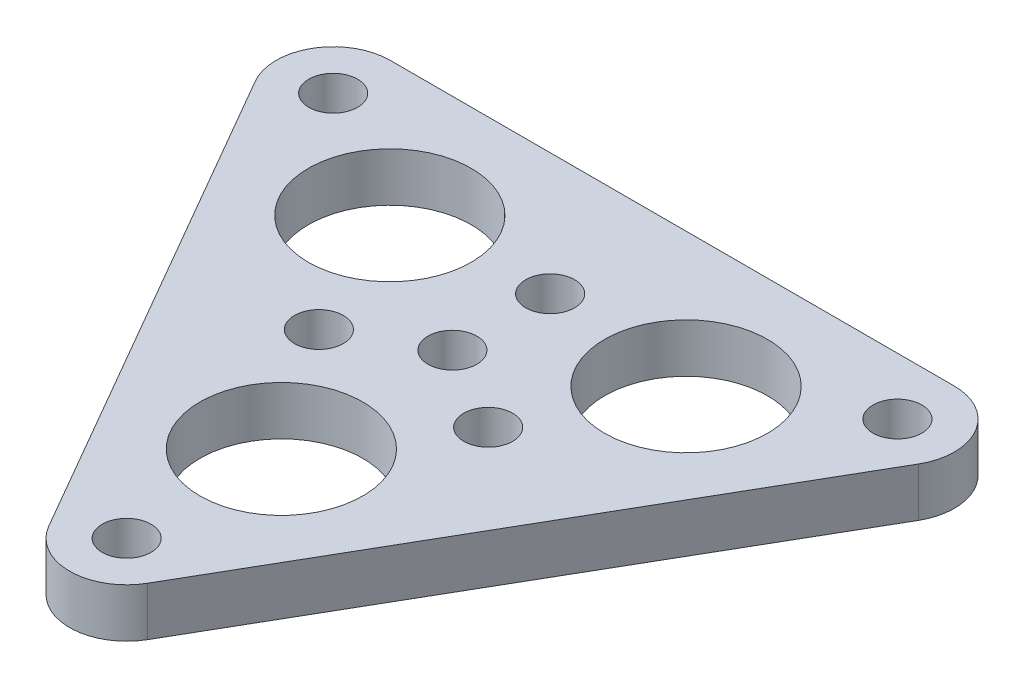
ISO-10303-21;
HEADER;
FILE_DESCRIPTION(('STEP AP214'),'2;1');
FILE_NAME('part.step','',(''),(''),'','','');
FILE_SCHEMA(('AUTOMOTIVE_DESIGN { 1 0 10303 214 1 1 1 1 }'));
ENDSEC;
DATA;
#1=APPLICATION_CONTEXT('core data for automotive mechanical design processes');
#2=APPLICATION_PROTOCOL_DEFINITION('international standard','automotive_design',2000,#1);
#3=PRODUCT_CONTEXT('',#1,'mechanical');
#4=PRODUCT('Part','Part','',(#3));
#5=PRODUCT_RELATED_PRODUCT_CATEGORY('part','',(#4));
#6=PRODUCT_DEFINITION_FORMATION('','',#4);
#7=PRODUCT_DEFINITION_CONTEXT('part definition',#1,'design');
#8=PRODUCT_DEFINITION('design','',#6,#7);
#9=PRODUCT_DEFINITION_SHAPE('','',#8);
#10=(LENGTH_UNIT() NAMED_UNIT(*) SI_UNIT(.MILLI.,.METRE.));
#11=(NAMED_UNIT(*) PLANE_ANGLE_UNIT() SI_UNIT($,.RADIAN.));
#12=(NAMED_UNIT(*) SI_UNIT($,.STERADIAN.) SOLID_ANGLE_UNIT());
#13=UNCERTAINTY_MEASURE_WITH_UNIT(LENGTH_MEASURE(1.E-05),#10,'distance_accuracy_value','');
#14=(GEOMETRIC_REPRESENTATION_CONTEXT(3) GLOBAL_UNCERTAINTY_ASSIGNED_CONTEXT((#13)) GLOBAL_UNIT_ASSIGNED_CONTEXT((#10,
#11,#12)) REPRESENTATION_CONTEXT('',''));
#15=CARTESIAN_POINT('',(0.,0.,0.));
#16=DIRECTION('',(0.,0.,1.));
#17=DIRECTION('',(1.,0.,0.));
#18=AXIS2_PLACEMENT_3D('',#15,#16,#17);
#19=CARTESIAN_POINT('',(0.,3.,20.));
#20=DIRECTION('',(0.,1.,0.));
#21=DIRECTION('',(0.,0.,1.));
#22=AXIS2_PLACEMENT_3D('',#19,#20,#21);
#23=PLANE('',#22);
#24=CARTESIAN_POINT('',(9.0932667397366,3.,-5.25000000000001));
#25=DIRECTION('',(0.,1.,0.));
#26=DIRECTION('',(0.,0.,1.));
#27=AXIS2_PLACEMENT_3D('',#24,#25,#26);
#28=CIRCLE('',#27,5.);
#29=CARTESIAN_POINT('',(9.0932667397366,3.,-0.250000000000004));
#30=VERTEX_POINT('',#29);
#31=EDGE_CURVE('E216',#30,#30,#28,.T.);
#32=ORIENTED_EDGE('',*,*,#31,.F.);
#33=EDGE_LOOP('',(#32));
#34=FACE_BOUND('',#33,.T.);
#35=CARTESIAN_POINT('',(5.19615242270664,3.,3.));
#36=DIRECTION('',(0.,1.,0.));
#37=DIRECTION('',(0.,0.,1.));
#38=AXIS2_PLACEMENT_3D('',#35,#36,#37);
#39=CIRCLE('',#38,1.5);
#40=CARTESIAN_POINT('',(5.19615242270664,3.,4.5));
#41=VERTEX_POINT('',#40);
#42=EDGE_CURVE('E228',#41,#41,#39,.T.);
#43=ORIENTED_EDGE('',*,*,#42,.F.);
#44=EDGE_LOOP('',(#43));
#45=FACE_BOUND('',#44,.T.);
#46=CARTESIAN_POINT('',(0.,3.,10.5));
#47=DIRECTION('',(0.,1.,0.));
#48=DIRECTION('',(0.,0.,1.));
#49=AXIS2_PLACEMENT_3D('',#46,#47,#48);
#50=CIRCLE('',#49,5.);
#51=CARTESIAN_POINT('',(0.,3.,15.5));
#52=VERTEX_POINT('',#51);
#53=EDGE_CURVE('E240',#52,#52,#50,.T.);
#54=ORIENTED_EDGE('',*,*,#53,.F.);
#55=EDGE_LOOP('',(#54));
#56=FACE_BOUND('',#55,.T.);
#57=CARTESIAN_POINT('',(17.3205080756888,3.,-10.));
#58=DIRECTION('',(0.,1.,0.));
#59=DIRECTION('',(0.,0.,1.));
#60=AXIS2_PLACEMENT_3D('',#57,#58,#59);
#61=CIRCLE('',#60,1.5);
#62=CARTESIAN_POINT('',(17.3205080756888,3.,-8.50000000000001));
#63=VERTEX_POINT('',#62);
#64=EDGE_CURVE('E252',#63,#63,#61,.T.);
#65=ORIENTED_EDGE('',*,*,#64,.F.);
#66=EDGE_LOOP('',(#65));
#67=FACE_BOUND('',#66,.T.);
#68=CARTESIAN_POINT('',(0.,3.,20.));
#69=DIRECTION('',(0.,1.,0.));
#70=DIRECTION('',(0.,0.,1.));
#71=AXIS2_PLACEMENT_3D('',#68,#69,#70);
#72=CIRCLE('',#71,1.5);
#73=CARTESIAN_POINT('',(0.,3.,21.5));
#74=VERTEX_POINT('',#73);
#75=EDGE_CURVE('E125',#74,#74,#72,.T.);
#76=ORIENTED_EDGE('',*,*,#75,.F.);
#77=EDGE_LOOP('',(#76));
#78=FACE_BOUND('',#77,.T.);
#79=CARTESIAN_POINT('',(0.,3.,20.));
#80=DIRECTION('',(0.,1.,0.));
#81=DIRECTION('',(0.,0.,1.));
#82=AXIS2_PLACEMENT_3D('',#79,#80,#81);
#83=CIRCLE('',#82,3.49999999999999);
#84=CARTESIAN_POINT('',(-3.03108891324553,3.,21.75));
#85=VERTEX_POINT('',#84);
#86=CARTESIAN_POINT('',(3.03108891324553,3.,21.75));
#87=VERTEX_POINT('',#86);
#88=EDGE_CURVE('E132',#85,#87,#83,.T.);
#89=ORIENTED_EDGE('',*,*,#88,.T.);
#90=DIRECTION('',(0.5,0.,-0.866025403784439));
#91=VECTOR('',#90,1.);
#92=CARTESIAN_POINT('',(3.03108891324553,3.,21.75));
#93=LINE('',#92,#91);
#94=CARTESIAN_POINT('',(20.3515969889343,3.,-8.25000000000001));
#95=VERTEX_POINT('',#94);
#96=EDGE_CURVE('E90',#87,#95,#93,.T.);
#97=ORIENTED_EDGE('',*,*,#96,.T.);
#98=CARTESIAN_POINT('',(17.3205080756888,3.,-10.));
#99=DIRECTION('',(0.,1.,0.));
#100=DIRECTION('',(0.,0.,1.));
#101=AXIS2_PLACEMENT_3D('',#98,#99,#100);
#102=CIRCLE('',#101,3.49999999999999);
#103=CARTESIAN_POINT('',(17.3205080756888,3.,-13.5));
#104=VERTEX_POINT('',#103);
#105=EDGE_CURVE('E103',#95,#104,#102,.T.);
#106=ORIENTED_EDGE('',*,*,#105,.T.);
#107=DIRECTION('',(-1.,0.,0.));
#108=VECTOR('',#107,1.);
#109=CARTESIAN_POINT('',(17.3205080756888,3.,-13.5));
#110=LINE('',#109,#108);
#111=CARTESIAN_POINT('',(-17.3205080756888,3.,-13.5));
#112=VERTEX_POINT('',#111);
#113=EDGE_CURVE('E97',#104,#112,#110,.T.);
#114=ORIENTED_EDGE('',*,*,#113,.T.);
#115=CARTESIAN_POINT('',(-17.3205080756888,3.,-9.99999999999999));
#116=DIRECTION('',(0.,1.,0.));
#117=DIRECTION('',(0.,0.,1.));
#118=AXIS2_PLACEMENT_3D('',#115,#116,#117);
#119=CIRCLE('',#118,3.49999999999999);
#120=CARTESIAN_POINT('',(-20.3515969889343,3.,-8.25000000000001));
#121=VERTEX_POINT('',#120);
#122=EDGE_CURVE('E101',#112,#121,#119,.T.);
#123=ORIENTED_EDGE('',*,*,#122,.T.);
#124=DIRECTION('',(0.5,0.,0.866025403784439));
#125=VECTOR('',#124,1.);
#126=CARTESIAN_POINT('',(-20.3515969889343,3.,-8.25000000000001));
#127=LINE('',#126,#125);
#128=EDGE_CURVE('E53',#121,#85,#127,.T.);
#129=ORIENTED_EDGE('',*,*,#128,.T.);
#130=EDGE_LOOP('',(#89,#97,#106,#114,#123,#129));
#131=FACE_BOUND('',#130,.T.);
#132=CARTESIAN_POINT('',(-17.3205080756888,3.,-9.99999999999999));
#133=DIRECTION('',(0.,1.,0.));
#134=DIRECTION('',(0.,0.,1.));
#135=AXIS2_PLACEMENT_3D('',#132,#133,#134);
#136=CIRCLE('',#135,1.5);
#137=CARTESIAN_POINT('',(-17.3205080756888,3.,-8.5));
#138=VERTEX_POINT('',#137);
#139=EDGE_CURVE('E258',#138,#138,#136,.T.);
#140=ORIENTED_EDGE('',*,*,#139,.F.);
#141=EDGE_LOOP('',(#140));
#142=FACE_BOUND('',#141,.T.);
#143=CARTESIAN_POINT('',(0.,3.,-6.));
#144=DIRECTION('',(0.,1.,0.));
#145=DIRECTION('',(0.,0.,1.));
#146=AXIS2_PLACEMENT_3D('',#143,#144,#145);
#147=CIRCLE('',#146,1.5);
#148=CARTESIAN_POINT('',(0.,3.,-4.5));
#149=VERTEX_POINT('',#148);
#150=EDGE_CURVE('E246',#149,#149,#147,.T.);
#151=ORIENTED_EDGE('',*,*,#150,.F.);
#152=EDGE_LOOP('',(#151));
#153=FACE_BOUND('',#152,.T.);
#154=CARTESIAN_POINT('',(0.,3.,0.));
#155=DIRECTION('',(0.,1.,0.));
#156=DIRECTION('',(0.,0.,1.));
#157=AXIS2_PLACEMENT_3D('',#154,#155,#156);
#158=CIRCLE('',#157,1.5);
#159=CARTESIAN_POINT('',(0.,3.,1.5));
#160=VERTEX_POINT('',#159);
#161=EDGE_CURVE('E234',#160,#160,#158,.T.);
#162=ORIENTED_EDGE('',*,*,#161,.F.);
#163=EDGE_LOOP('',(#162));
#164=FACE_BOUND('',#163,.T.);
#165=CARTESIAN_POINT('',(-9.09326673973661,3.,-5.25));
#166=DIRECTION('',(0.,1.,0.));
#167=DIRECTION('',(0.,0.,1.));
#168=AXIS2_PLACEMENT_3D('',#165,#166,#167);
#169=CIRCLE('',#168,5.);
#170=CARTESIAN_POINT('',(-9.09326673973661,3.,-0.249999999999995));
#171=VERTEX_POINT('',#170);
#172=EDGE_CURVE('E222',#171,#171,#169,.T.);
#173=ORIENTED_EDGE('',*,*,#172,.F.);
#174=EDGE_LOOP('',(#173));
#175=FACE_BOUND('',#174,.T.);
#176=CARTESIAN_POINT('',(-5.19615242270663,3.,3.00000000000001));
#177=DIRECTION('',(0.,1.,0.));
#178=DIRECTION('',(0.,0.,1.));
#179=AXIS2_PLACEMENT_3D('',#176,#177,#178);
#180=CIRCLE('',#179,1.5);
#181=CARTESIAN_POINT('',(-5.19615242270663,3.,4.50000000000001));
#182=VERTEX_POINT('',#181);
#183=EDGE_CURVE('E207',#182,#182,#180,.T.);
#184=ORIENTED_EDGE('',*,*,#183,.F.);
#185=EDGE_LOOP('',(#184));
#186=FACE_BOUND('',#185,.T.);
#187=ADVANCED_FACE('F36',(#34,#45,#56,#67,#78,#131,#142,#153,#164,#175,#186),#23,.T.);
#188=CARTESIAN_POINT('',(0.,0.,20.));
#189=DIRECTION('',(0.,1.,0.));
#190=DIRECTION('',(0.,0.,1.));
#191=AXIS2_PLACEMENT_3D('',#188,#189,#190);
#192=PLANE('',#191);
#193=CARTESIAN_POINT('',(0.,0.,20.));
#194=DIRECTION('',(0.,1.,0.));
#195=DIRECTION('',(0.,0.,1.));
#196=AXIS2_PLACEMENT_3D('',#193,#194,#195);
#197=CIRCLE('',#196,3.49999999999999);
#198=CARTESIAN_POINT('',(-3.03108891324553,0.,21.75));
#199=VERTEX_POINT('',#198);
#200=CARTESIAN_POINT('',(3.03108891324553,0.,21.75));
#201=VERTEX_POINT('',#200);
#202=EDGE_CURVE('E121',#199,#201,#197,.T.);
#203=ORIENTED_EDGE('',*,*,#202,.F.);
#204=DIRECTION('',(0.5,0.,0.866025403784439));
#205=VECTOR('',#204,1.);
#206=CARTESIAN_POINT('',(-20.3515969889343,0.,-8.25000000000001));
#207=LINE('',#206,#205);
#208=CARTESIAN_POINT('',(-20.3515969889343,0.,-8.25000000000001));
#209=VERTEX_POINT('',#208);
#210=EDGE_CURVE('E82',#209,#199,#207,.T.);
#211=ORIENTED_EDGE('',*,*,#210,.F.);
#212=CARTESIAN_POINT('',(-17.3205080756888,0.,-9.99999999999999));
#213=DIRECTION('',(0.,1.,0.));
#214=DIRECTION('',(0.,0.,1.));
#215=AXIS2_PLACEMENT_3D('',#212,#213,#214);
#216=CIRCLE('',#215,3.49999999999999);
#217=CARTESIAN_POINT('',(-17.3205080756888,0.,-13.5));
#218=VERTEX_POINT('',#217);
#219=EDGE_CURVE('E76',#218,#209,#216,.T.);
#220=ORIENTED_EDGE('',*,*,#219,.F.);
#221=DIRECTION('',(-1.,0.,0.));
#222=VECTOR('',#221,1.);
#223=CARTESIAN_POINT('',(17.3205080756888,0.,-13.5));
#224=LINE('',#223,#222);
#225=CARTESIAN_POINT('',(17.3205080756888,0.,-13.5));
#226=VERTEX_POINT('',#225);
#227=EDGE_CURVE('E111',#226,#218,#224,.T.);
#228=ORIENTED_EDGE('',*,*,#227,.F.);
#229=CARTESIAN_POINT('',(17.3205080756888,0.,-10.));
#230=DIRECTION('',(0.,1.,0.));
#231=DIRECTION('',(0.,0.,1.));
#232=AXIS2_PLACEMENT_3D('',#229,#230,#231);
#233=CIRCLE('',#232,3.49999999999999);
#234=CARTESIAN_POINT('',(20.3515969889343,0.,-8.25000000000001));
#235=VERTEX_POINT('',#234);
#236=EDGE_CURVE('E127',#235,#226,#233,.T.);
#237=ORIENTED_EDGE('',*,*,#236,.F.);
#238=DIRECTION('',(0.5,0.,-0.866025403784439));
#239=VECTOR('',#238,1.);
#240=CARTESIAN_POINT('',(3.03108891324553,0.,21.75));
#241=LINE('',#240,#239);
#242=EDGE_CURVE('E124',#201,#235,#241,.T.);
#243=ORIENTED_EDGE('',*,*,#242,.F.);
#244=EDGE_LOOP('',(#203,#211,#220,#228,#237,#243));
#245=FACE_BOUND('',#244,.T.);
#246=CARTESIAN_POINT('',(0.,0.,20.));
#247=DIRECTION('',(0.,1.,0.));
#248=DIRECTION('',(0.,0.,1.));
#249=AXIS2_PLACEMENT_3D('',#246,#247,#248);
#250=CIRCLE('',#249,1.5);
#251=CARTESIAN_POINT('',(0.,0.,21.5));
#252=VERTEX_POINT('',#251);
#253=EDGE_CURVE('E261',#252,#252,#250,.T.);
#254=ORIENTED_EDGE('',*,*,#253,.T.);
#255=EDGE_LOOP('',(#254));
#256=FACE_BOUND('',#255,.T.);
#257=CARTESIAN_POINT('',(-17.3205080756888,0.,-9.99999999999999));
#258=DIRECTION('',(0.,1.,0.));
#259=DIRECTION('',(0.,0.,1.));
#260=AXIS2_PLACEMENT_3D('',#257,#258,#259);
#261=CIRCLE('',#260,1.5);
#262=CARTESIAN_POINT('',(-17.3205080756888,0.,-8.5));
#263=VERTEX_POINT('',#262);
#264=EDGE_CURVE('E255',#263,#263,#261,.T.);
#265=ORIENTED_EDGE('',*,*,#264,.T.);
#266=EDGE_LOOP('',(#265));
#267=FACE_BOUND('',#266,.T.);
#268=CARTESIAN_POINT('',(17.3205080756888,0.,-10.));
#269=DIRECTION('',(0.,1.,0.));
#270=DIRECTION('',(0.,0.,1.));
#271=AXIS2_PLACEMENT_3D('',#268,#269,#270);
#272=CIRCLE('',#271,1.5);
#273=CARTESIAN_POINT('',(17.3205080756888,0.,-8.50000000000001));
#274=VERTEX_POINT('',#273);
#275=EDGE_CURVE('E249',#274,#274,#272,.T.);
#276=ORIENTED_EDGE('',*,*,#275,.T.);
#277=EDGE_LOOP('',(#276));
#278=FACE_BOUND('',#277,.T.);
#279=CARTESIAN_POINT('',(0.,0.,-6.));
#280=DIRECTION('',(0.,1.,0.));
#281=DIRECTION('',(0.,0.,1.));
#282=AXIS2_PLACEMENT_3D('',#279,#280,#281);
#283=CIRCLE('',#282,1.5);
#284=CARTESIAN_POINT('',(0.,0.,-4.5));
#285=VERTEX_POINT('',#284);
#286=EDGE_CURVE('E243',#285,#285,#283,.T.);
#287=ORIENTED_EDGE('',*,*,#286,.T.);
#288=EDGE_LOOP('',(#287));
#289=FACE_BOUND('',#288,.T.);
#290=CARTESIAN_POINT('',(0.,0.,10.5));
#291=DIRECTION('',(0.,1.,0.));
#292=DIRECTION('',(0.,0.,1.));
#293=AXIS2_PLACEMENT_3D('',#290,#291,#292);
#294=CIRCLE('',#293,5.);
#295=CARTESIAN_POINT('',(0.,0.,15.5));
#296=VERTEX_POINT('',#295);
#297=EDGE_CURVE('E237',#296,#296,#294,.T.);
#298=ORIENTED_EDGE('',*,*,#297,.T.);
#299=EDGE_LOOP('',(#298));
#300=FACE_BOUND('',#299,.T.);
#301=CARTESIAN_POINT('',(0.,0.,0.));
#302=DIRECTION('',(0.,1.,0.));
#303=DIRECTION('',(0.,0.,1.));
#304=AXIS2_PLACEMENT_3D('',#301,#302,#303);
#305=CIRCLE('',#304,1.5);
#306=CARTESIAN_POINT('',(0.,0.,1.5));
#307=VERTEX_POINT('',#306);
#308=EDGE_CURVE('E231',#307,#307,#305,.T.);
#309=ORIENTED_EDGE('',*,*,#308,.T.);
#310=EDGE_LOOP('',(#309));
#311=FACE_BOUND('',#310,.T.);
#312=CARTESIAN_POINT('',(5.19615242270664,0.,3.));
#313=DIRECTION('',(0.,1.,0.));
#314=DIRECTION('',(0.,0.,1.));
#315=AXIS2_PLACEMENT_3D('',#312,#313,#314);
#316=CIRCLE('',#315,1.5);
#317=CARTESIAN_POINT('',(5.19615242270664,0.,4.5));
#318=VERTEX_POINT('',#317);
#319=EDGE_CURVE('E225',#318,#318,#316,.T.);
#320=ORIENTED_EDGE('',*,*,#319,.T.);
#321=EDGE_LOOP('',(#320));
#322=FACE_BOUND('',#321,.T.);
#323=CARTESIAN_POINT('',(-9.09326673973661,0.,-5.25));
#324=DIRECTION('',(0.,1.,0.));
#325=DIRECTION('',(0.,0.,1.));
#326=AXIS2_PLACEMENT_3D('',#323,#324,#325);
#327=CIRCLE('',#326,5.);
#328=CARTESIAN_POINT('',(-9.09326673973661,0.,-0.249999999999995));
#329=VERTEX_POINT('',#328);
#330=EDGE_CURVE('E219',#329,#329,#327,.T.);
#331=ORIENTED_EDGE('',*,*,#330,.T.);
#332=EDGE_LOOP('',(#331));
#333=FACE_BOUND('',#332,.T.);
#334=CARTESIAN_POINT('',(9.0932667397366,0.,-5.25000000000001));
#335=DIRECTION('',(0.,1.,0.));
#336=DIRECTION('',(0.,0.,1.));
#337=AXIS2_PLACEMENT_3D('',#334,#335,#336);
#338=CIRCLE('',#337,5.);
#339=CARTESIAN_POINT('',(9.0932667397366,0.,-0.250000000000004));
#340=VERTEX_POINT('',#339);
#341=EDGE_CURVE('E213',#340,#340,#338,.T.);
#342=ORIENTED_EDGE('',*,*,#341,.T.);
#343=EDGE_LOOP('',(#342));
#344=FACE_BOUND('',#343,.T.);
#345=CARTESIAN_POINT('',(-5.19615242270663,0.,3.00000000000001));
#346=DIRECTION('',(0.,1.,0.));
#347=DIRECTION('',(0.,0.,1.));
#348=AXIS2_PLACEMENT_3D('',#345,#346,#347);
#349=CIRCLE('',#348,1.5);
#350=CARTESIAN_POINT('',(-5.19615242270663,0.,4.50000000000001));
#351=VERTEX_POINT('',#350);
#352=EDGE_CURVE('E210',#351,#351,#349,.T.);
#353=ORIENTED_EDGE('',*,*,#352,.T.);
#354=EDGE_LOOP('',(#353));
#355=FACE_BOUND('',#354,.T.);
#356=ADVANCED_FACE('F141',(#245,#256,#267,#278,#289,#300,#311,#322,#333,#344,#355),#192,.F.);
#357=CARTESIAN_POINT('',(0.,3.,20.));
#358=DIRECTION('',(0.,-1.,0.));
#359=DIRECTION('',(0.,0.,-1.));
#360=AXIS2_PLACEMENT_3D('',#357,#358,#359);
#361=CYLINDRICAL_SURFACE('',#360,3.49999999999999);
#362=ORIENTED_EDGE('',*,*,#202,.T.);
#363=DIRECTION('',(0.,-1.,0.));
#364=VECTOR('',#363,1.);
#365=CARTESIAN_POINT('',(3.03108891324553,3.,21.75));
#366=LINE('',#365,#364);
#367=EDGE_CURVE('E11',#87,#201,#366,.T.);
#368=ORIENTED_EDGE('',*,*,#367,.F.);
#369=ORIENTED_EDGE('',*,*,#88,.F.);
#370=DIRECTION('',(0.,-1.,0.));
#371=VECTOR('',#370,1.);
#372=CARTESIAN_POINT('',(-3.03108891324553,3.,21.75));
#373=LINE('',#372,#371);
#374=EDGE_CURVE('E117',#85,#199,#373,.T.);
#375=ORIENTED_EDGE('',*,*,#374,.T.);
#376=EDGE_LOOP('',(#362,#368,#369,#375));
#377=FACE_BOUND('',#376,.T.);
#378=ADVANCED_FACE('F38',(#377),#361,.T.);
#379=CARTESIAN_POINT('',(3.03108891324553,3.,21.75));
#380=DIRECTION('',(-0.866025403784439,0.,-0.5));
#381=DIRECTION('',(-0.5,0.,0.866025403784439));
#382=AXIS2_PLACEMENT_3D('',#379,#380,#381);
#383=PLANE('',#382);
#384=ORIENTED_EDGE('',*,*,#242,.T.);
#385=DIRECTION('',(0.,-1.,0.));
#386=VECTOR('',#385,1.);
#387=CARTESIAN_POINT('',(20.3515969889343,3.,-8.25000000000001));
#388=LINE('',#387,#386);
#389=EDGE_CURVE('E45',#95,#235,#388,.T.);
#390=ORIENTED_EDGE('',*,*,#389,.F.);
#391=ORIENTED_EDGE('',*,*,#96,.F.);
#392=ORIENTED_EDGE('',*,*,#367,.T.);
#393=EDGE_LOOP('',(#384,#390,#391,#392));
#394=FACE_BOUND('',#393,.T.);
#395=ADVANCED_FACE('F373',(#394),#383,.F.);
#396=CARTESIAN_POINT('',(17.3205080756888,3.,-10.));
#397=DIRECTION('',(0.,-1.,0.));
#398=DIRECTION('',(0.,0.,-1.));
#399=AXIS2_PLACEMENT_3D('',#396,#397,#398);
#400=CYLINDRICAL_SURFACE('',#399,3.49999999999999);
#401=ORIENTED_EDGE('',*,*,#236,.T.);
#402=DIRECTION('',(0.,-1.,0.));
#403=VECTOR('',#402,1.);
#404=CARTESIAN_POINT('',(17.3205080756888,3.,-13.5));
#405=LINE('',#404,#403);
#406=EDGE_CURVE('E112',#104,#226,#405,.T.);
#407=ORIENTED_EDGE('',*,*,#406,.F.);
#408=ORIENTED_EDGE('',*,*,#105,.F.);
#409=ORIENTED_EDGE('',*,*,#389,.T.);
#410=EDGE_LOOP('',(#401,#407,#408,#409));
#411=FACE_BOUND('',#410,.T.);
#412=ADVANCED_FACE('F138',(#411),#400,.T.);
#413=CARTESIAN_POINT('',(17.3205080756888,3.,-13.5));
#414=DIRECTION('',(0.,0.,1.));
#415=DIRECTION('',(1.,0.,0.));
#416=AXIS2_PLACEMENT_3D('',#413,#414,#415);
#417=PLANE('',#416);
#418=ORIENTED_EDGE('',*,*,#227,.T.);
#419=DIRECTION('',(0.,-1.,0.));
#420=VECTOR('',#419,1.);
#421=CARTESIAN_POINT('',(-17.3205080756888,3.,-13.5));
#422=LINE('',#421,#420);
#423=EDGE_CURVE('E108',#112,#218,#422,.T.);
#424=ORIENTED_EDGE('',*,*,#423,.F.);
#425=ORIENTED_EDGE('',*,*,#113,.F.);
#426=ORIENTED_EDGE('',*,*,#406,.T.);
#427=EDGE_LOOP('',(#418,#424,#425,#426));
#428=FACE_BOUND('',#427,.T.);
#429=ADVANCED_FACE('F109',(#428),#417,.F.);
#430=CARTESIAN_POINT('',(-17.3205080756888,3.,-9.99999999999999));
#431=DIRECTION('',(0.,-1.,0.));
#432=DIRECTION('',(0.,0.,-1.));
#433=AXIS2_PLACEMENT_3D('',#430,#431,#432);
#434=CYLINDRICAL_SURFACE('',#433,3.49999999999999);
#435=ORIENTED_EDGE('',*,*,#219,.T.);
#436=DIRECTION('',(0.,-1.,0.));
#437=VECTOR('',#436,1.);
#438=CARTESIAN_POINT('',(-20.3515969889343,3.,-8.25000000000001));
#439=LINE('',#438,#437);
#440=EDGE_CURVE('E113',#121,#209,#439,.T.);
#441=ORIENTED_EDGE('',*,*,#440,.F.);
#442=ORIENTED_EDGE('',*,*,#122,.F.);
#443=ORIENTED_EDGE('',*,*,#423,.T.);
#444=EDGE_LOOP('',(#435,#441,#442,#443));
#445=FACE_BOUND('',#444,.T.);
#446=ADVANCED_FACE('F115',(#445),#434,.T.);
#447=CARTESIAN_POINT('',(-20.3515969889343,3.,-8.25000000000001));
#448=DIRECTION('',(0.866025403784438,0.,-0.5));
#449=DIRECTION('',(-0.5,0.,-0.866025403784439));
#450=AXIS2_PLACEMENT_3D('',#447,#448,#449);
#451=PLANE('',#450);
#452=ORIENTED_EDGE('',*,*,#210,.T.);
#453=ORIENTED_EDGE('',*,*,#374,.F.);
#454=ORIENTED_EDGE('',*,*,#128,.F.);
#455=ORIENTED_EDGE('',*,*,#440,.T.);
#456=EDGE_LOOP('',(#452,#453,#454,#455));
#457=FACE_BOUND('',#456,.T.);
#458=ADVANCED_FACE('F146',(#457),#451,.F.);
#459=CARTESIAN_POINT('',(0.,3.,20.));
#460=DIRECTION('',(0.,-1.,0.));
#461=DIRECTION('',(0.,0.,-1.));
#462=AXIS2_PLACEMENT_3D('',#459,#460,#461);
#463=CYLINDRICAL_SURFACE('',#462,1.5);
#464=ORIENTED_EDGE('',*,*,#75,.T.);
#465=EDGE_LOOP('',(#464));
#466=FACE_BOUND('',#465,.T.);
#467=ORIENTED_EDGE('',*,*,#253,.F.);
#468=EDGE_LOOP('',(#467));
#469=FACE_BOUND('',#468,.T.);
#470=ADVANCED_FACE('F148',(#466,#469),#463,.F.);
#471=CARTESIAN_POINT('',(-17.3205080756888,3.,-9.99999999999999));
#472=DIRECTION('',(0.,-1.,0.));
#473=DIRECTION('',(0.,0.,-1.));
#474=AXIS2_PLACEMENT_3D('',#471,#472,#473);
#475=CYLINDRICAL_SURFACE('',#474,1.5);
#476=ORIENTED_EDGE('',*,*,#139,.T.);
#477=EDGE_LOOP('',(#476));
#478=FACE_BOUND('',#477,.T.);
#479=ORIENTED_EDGE('',*,*,#264,.F.);
#480=EDGE_LOOP('',(#479));
#481=FACE_BOUND('',#480,.T.);
#482=ADVANCED_FACE('F154',(#478,#481),#475,.F.);
#483=CARTESIAN_POINT('',(17.3205080756888,3.,-10.));
#484=DIRECTION('',(0.,-1.,0.));
#485=DIRECTION('',(0.,0.,-1.));
#486=AXIS2_PLACEMENT_3D('',#483,#484,#485);
#487=CYLINDRICAL_SURFACE('',#486,1.5);
#488=ORIENTED_EDGE('',*,*,#64,.T.);
#489=EDGE_LOOP('',(#488));
#490=FACE_BOUND('',#489,.T.);
#491=ORIENTED_EDGE('',*,*,#275,.F.);
#492=EDGE_LOOP('',(#491));
#493=FACE_BOUND('',#492,.T.);
#494=ADVANCED_FACE('F170',(#490,#493),#487,.F.);
#495=CARTESIAN_POINT('',(0.,3.,-6.));
#496=DIRECTION('',(0.,-1.,0.));
#497=DIRECTION('',(0.,0.,-1.));
#498=AXIS2_PLACEMENT_3D('',#495,#496,#497);
#499=CYLINDRICAL_SURFACE('',#498,1.5);
#500=ORIENTED_EDGE('',*,*,#150,.T.);
#501=EDGE_LOOP('',(#500));
#502=FACE_BOUND('',#501,.T.);
#503=ORIENTED_EDGE('',*,*,#286,.F.);
#504=EDGE_LOOP('',(#503));
#505=FACE_BOUND('',#504,.T.);
#506=ADVANCED_FACE('F174',(#502,#505),#499,.F.);
#507=CARTESIAN_POINT('',(0.,3.,10.5));
#508=DIRECTION('',(0.,-1.,0.));
#509=DIRECTION('',(0.,0.,-1.));
#510=AXIS2_PLACEMENT_3D('',#507,#508,#509);
#511=CYLINDRICAL_SURFACE('',#510,5.);
#512=ORIENTED_EDGE('',*,*,#53,.T.);
#513=EDGE_LOOP('',(#512));
#514=FACE_BOUND('',#513,.T.);
#515=ORIENTED_EDGE('',*,*,#297,.F.);
#516=EDGE_LOOP('',(#515));
#517=FACE_BOUND('',#516,.T.);
#518=ADVANCED_FACE('F178',(#514,#517),#511,.F.);
#519=CARTESIAN_POINT('',(0.,3.,0.));
#520=DIRECTION('',(0.,-1.,0.));
#521=DIRECTION('',(0.,0.,-1.));
#522=AXIS2_PLACEMENT_3D('',#519,#520,#521);
#523=CYLINDRICAL_SURFACE('',#522,1.5);
#524=ORIENTED_EDGE('',*,*,#161,.T.);
#525=EDGE_LOOP('',(#524));
#526=FACE_BOUND('',#525,.T.);
#527=ORIENTED_EDGE('',*,*,#308,.F.);
#528=EDGE_LOOP('',(#527));
#529=FACE_BOUND('',#528,.T.);
#530=ADVANCED_FACE('F182',(#526,#529),#523,.F.);
#531=CARTESIAN_POINT('',(5.19615242270664,3.,3.));
#532=DIRECTION('',(0.,-1.,0.));
#533=DIRECTION('',(0.,0.,-1.));
#534=AXIS2_PLACEMENT_3D('',#531,#532,#533);
#535=CYLINDRICAL_SURFACE('',#534,1.5);
#536=ORIENTED_EDGE('',*,*,#42,.T.);
#537=EDGE_LOOP('',(#536));
#538=FACE_BOUND('',#537,.T.);
#539=ORIENTED_EDGE('',*,*,#319,.F.);
#540=EDGE_LOOP('',(#539));
#541=FACE_BOUND('',#540,.T.);
#542=ADVANCED_FACE('F186',(#538,#541),#535,.F.);
#543=CARTESIAN_POINT('',(-9.09326673973661,3.,-5.25));
#544=DIRECTION('',(0.,-1.,0.));
#545=DIRECTION('',(0.,0.,-1.));
#546=AXIS2_PLACEMENT_3D('',#543,#544,#545);
#547=CYLINDRICAL_SURFACE('',#546,5.);
#548=ORIENTED_EDGE('',*,*,#172,.T.);
#549=EDGE_LOOP('',(#548));
#550=FACE_BOUND('',#549,.T.);
#551=ORIENTED_EDGE('',*,*,#330,.F.);
#552=EDGE_LOOP('',(#551));
#553=FACE_BOUND('',#552,.T.);
#554=ADVANCED_FACE('F190',(#550,#553),#547,.F.);
#555=CARTESIAN_POINT('',(9.0932667397366,3.,-5.25000000000001));
#556=DIRECTION('',(0.,-1.,0.));
#557=DIRECTION('',(0.,0.,-1.));
#558=AXIS2_PLACEMENT_3D('',#555,#556,#557);
#559=CYLINDRICAL_SURFACE('',#558,5.);
#560=ORIENTED_EDGE('',*,*,#31,.T.);
#561=EDGE_LOOP('',(#560));
#562=FACE_BOUND('',#561,.T.);
#563=ORIENTED_EDGE('',*,*,#341,.F.);
#564=EDGE_LOOP('',(#563));
#565=FACE_BOUND('',#564,.T.);
#566=ADVANCED_FACE('F194',(#562,#565),#559,.F.);
#567=CARTESIAN_POINT('',(-5.19615242270663,3.,3.00000000000001));
#568=DIRECTION('',(0.,-1.,0.));
#569=DIRECTION('',(0.,0.,-1.));
#570=AXIS2_PLACEMENT_3D('',#567,#568,#569);
#571=CYLINDRICAL_SURFACE('',#570,1.5);
#572=ORIENTED_EDGE('',*,*,#183,.T.);
#573=EDGE_LOOP('',(#572));
#574=FACE_BOUND('',#573,.T.);
#575=ORIENTED_EDGE('',*,*,#352,.F.);
#576=EDGE_LOOP('',(#575));
#577=FACE_BOUND('',#576,.T.);
#578=ADVANCED_FACE('F198',(#574,#577),#571,.F.);
#579=CLOSED_SHELL('',(#187,#356,#378,#395,#412,#429,#446,#458,#470,#482,#494,#506,#518,#530,
#542,#554,#566,#578));
#580=MANIFOLD_SOLID_BREP('B2',#579);
#581=ADVANCED_BREP_SHAPE_REPRESENTATION('',(#18,#580),#14);
#582=SHAPE_DEFINITION_REPRESENTATION(#9,#581);
ENDSEC;
END-ISO-10303-21;
